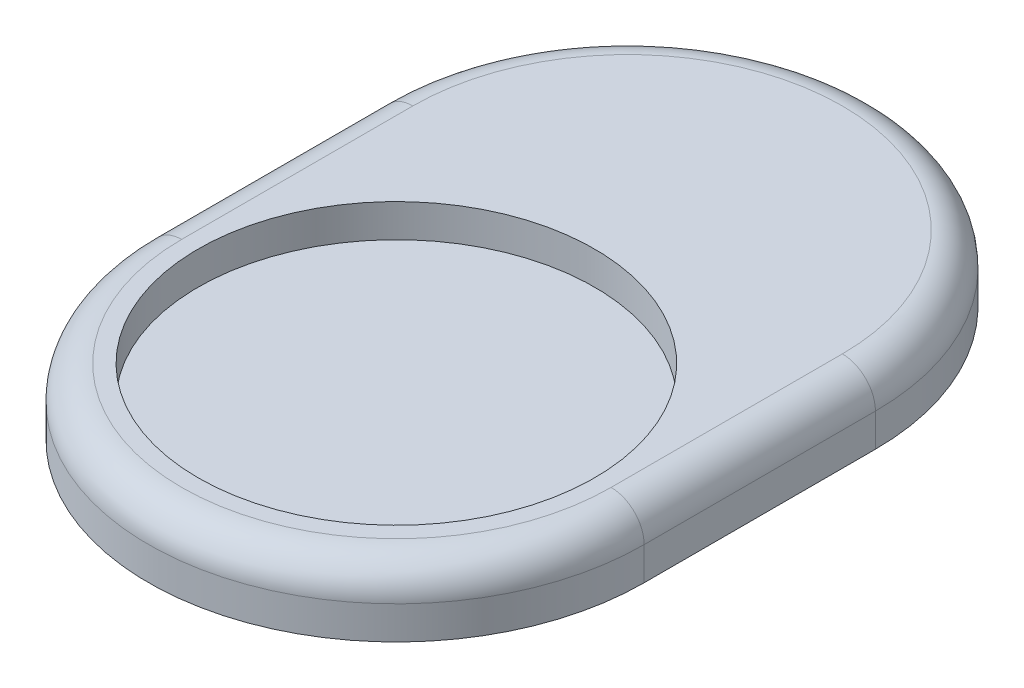
ISO-10303-21;
HEADER;
FILE_DESCRIPTION(('STEP AP214'),'2;1');
FILE_NAME('part.step','',(''),(''),'','','');
FILE_SCHEMA(('AUTOMOTIVE_DESIGN { 1 0 10303 214 1 1 1 1 }'));
ENDSEC;
DATA;
#1=APPLICATION_CONTEXT('core data for automotive mechanical design processes');
#2=APPLICATION_PROTOCOL_DEFINITION('international standard','automotive_design',2000,#1);
#3=PRODUCT_CONTEXT('',#1,'mechanical');
#4=PRODUCT('Part','Part','',(#3));
#5=PRODUCT_RELATED_PRODUCT_CATEGORY('part','',(#4));
#6=PRODUCT_DEFINITION_FORMATION('','',#4);
#7=PRODUCT_DEFINITION_CONTEXT('part definition',#1,'design');
#8=PRODUCT_DEFINITION('design','',#6,#7);
#9=PRODUCT_DEFINITION_SHAPE('','',#8);
#10=(LENGTH_UNIT() NAMED_UNIT(*) SI_UNIT(.MILLI.,.METRE.));
#11=(NAMED_UNIT(*) PLANE_ANGLE_UNIT() SI_UNIT($,.RADIAN.));
#12=(NAMED_UNIT(*) SI_UNIT($,.STERADIAN.) SOLID_ANGLE_UNIT());
#13=UNCERTAINTY_MEASURE_WITH_UNIT(LENGTH_MEASURE(1.E-05),#10,'distance_accuracy_value','');
#14=(GEOMETRIC_REPRESENTATION_CONTEXT(3) GLOBAL_UNCERTAINTY_ASSIGNED_CONTEXT((#13)) GLOBAL_UNIT_ASSIGNED_CONTEXT((#10,
#11,#12)) REPRESENTATION_CONTEXT('',''));
#15=CARTESIAN_POINT('',(0.,0.,0.));
#16=DIRECTION('',(0.,0.,1.));
#17=DIRECTION('',(1.,0.,0.));
#18=AXIS2_PLACEMENT_3D('',#15,#16,#17);
#19=CARTESIAN_POINT('',(0.,2.,0.));
#20=DIRECTION('',(0.,-1.,0.));
#21=DIRECTION('',(0.,0.,-1.));
#22=AXIS2_PLACEMENT_3D('',#19,#20,#21);
#23=CYLINDRICAL_SURFACE('',#22,7.5);
#24=DIRECTION('',(0.,-1.,0.));
#25=VECTOR('',#24,1.);
#26=CARTESIAN_POINT('',(7.5,2.,0.));
#27=LINE('',#26,#25);
#28=CARTESIAN_POINT('',(7.5,1.,0.));
#29=VERTEX_POINT('',#28);
#30=CARTESIAN_POINT('',(7.5,0.,0.));
#31=VERTEX_POINT('',#30);
#32=EDGE_CURVE('E87',#29,#31,#27,.T.);
#33=ORIENTED_EDGE('',*,*,#32,.F.);
#34=CARTESIAN_POINT('',(0.,1.,0.));
#35=DIRECTION('',(0.,1.,0.));
#36=DIRECTION('',(0.,0.,1.));
#37=AXIS2_PLACEMENT_3D('',#34,#35,#36);
#38=CIRCLE('',#37,7.5);
#39=CARTESIAN_POINT('',(-7.5,1.,0.));
#40=VERTEX_POINT('',#39);
#41=EDGE_CURVE('E133',#29,#40,#38,.F.);
#42=ORIENTED_EDGE('',*,*,#41,.T.);
#43=DIRECTION('',(0.,-1.,0.));
#44=VECTOR('',#43,1.);
#45=CARTESIAN_POINT('',(-7.5,2.,0.));
#46=LINE('',#45,#44);
#47=CARTESIAN_POINT('',(-7.5,0.,0.));
#48=VERTEX_POINT('',#47);
#49=EDGE_CURVE('E110',#40,#48,#46,.T.);
#50=ORIENTED_EDGE('',*,*,#49,.T.);
#51=CARTESIAN_POINT('',(0.,0.,0.));
#52=DIRECTION('',(0.,1.,0.));
#53=DIRECTION('',(0.,0.,1.));
#54=AXIS2_PLACEMENT_3D('',#51,#52,#53);
#55=CIRCLE('',#54,7.5);
#56=EDGE_CURVE('E105',#48,#31,#55,.T.);
#57=ORIENTED_EDGE('',*,*,#56,.T.);
#58=EDGE_LOOP('',(#33,#42,#50,#57));
#59=FACE_BOUND('',#58,.T.);
#60=ADVANCED_FACE('F34',(#59),#23,.T.);
#61=CARTESIAN_POINT('',(7.5,2.,0.));
#62=DIRECTION('',(-1.,0.,0.));
#63=DIRECTION('',(0.,0.,1.));
#64=AXIS2_PLACEMENT_3D('',#61,#62,#63);
#65=PLANE('',#64);
#66=DIRECTION('',(0.,-1.,0.));
#67=VECTOR('',#66,1.);
#68=CARTESIAN_POINT('',(7.5,2.,-7.));
#69=LINE('',#68,#67);
#70=CARTESIAN_POINT('',(7.5,1.,-7.));
#71=VERTEX_POINT('',#70);
#72=CARTESIAN_POINT('',(7.5,0.,-7.));
#73=VERTEX_POINT('',#72);
#74=EDGE_CURVE('E99',#71,#73,#69,.T.);
#75=ORIENTED_EDGE('',*,*,#74,.F.);
#76=DIRECTION('',(0.,0.,-1.));
#77=VECTOR('',#76,1.);
#78=CARTESIAN_POINT('',(7.5,1.,0.));
#79=LINE('',#78,#77);
#80=EDGE_CURVE('E93',#71,#29,#79,.F.);
#81=ORIENTED_EDGE('',*,*,#80,.T.);
#82=ORIENTED_EDGE('',*,*,#32,.T.);
#83=DIRECTION('',(0.,0.,-1.));
#84=VECTOR('',#83,1.);
#85=CARTESIAN_POINT('',(7.5,0.,0.));
#86=LINE('',#85,#84);
#87=EDGE_CURVE('E90',#31,#73,#86,.T.);
#88=ORIENTED_EDGE('',*,*,#87,.T.);
#89=EDGE_LOOP('',(#75,#81,#82,#88));
#90=FACE_BOUND('',#89,.T.);
#91=ADVANCED_FACE('F89',(#90),#65,.F.);
#92=CARTESIAN_POINT('',(0.,2.,-7.));
#93=DIRECTION('',(0.,-1.,0.));
#94=DIRECTION('',(0.,0.,-1.));
#95=AXIS2_PLACEMENT_3D('',#92,#93,#94);
#96=CYLINDRICAL_SURFACE('',#95,7.5);
#97=DIRECTION('',(0.,-1.,0.));
#98=VECTOR('',#97,1.);
#99=CARTESIAN_POINT('',(-7.5,2.,-7.));
#100=LINE('',#99,#98);
#101=CARTESIAN_POINT('',(-7.5,1.,-7.));
#102=VERTEX_POINT('',#101);
#103=CARTESIAN_POINT('',(-7.5,0.,-7.));
#104=VERTEX_POINT('',#103);
#105=EDGE_CURVE('E122',#102,#104,#100,.T.);
#106=ORIENTED_EDGE('',*,*,#105,.F.);
#107=CARTESIAN_POINT('',(0.,1.,-7.));
#108=DIRECTION('',(0.,1.,0.));
#109=DIRECTION('',(0.,0.,1.));
#110=AXIS2_PLACEMENT_3D('',#107,#108,#109);
#111=CIRCLE('',#110,7.5);
#112=EDGE_CURVE('E43',#102,#71,#111,.F.);
#113=ORIENTED_EDGE('',*,*,#112,.T.);
#114=ORIENTED_EDGE('',*,*,#74,.T.);
#115=CARTESIAN_POINT('',(0.,0.,-7.));
#116=DIRECTION('',(0.,1.,0.));
#117=DIRECTION('',(0.,0.,1.));
#118=AXIS2_PLACEMENT_3D('',#115,#116,#117);
#119=CIRCLE('',#118,7.5);
#120=EDGE_CURVE('E108',#73,#104,#119,.T.);
#121=ORIENTED_EDGE('',*,*,#120,.T.);
#122=EDGE_LOOP('',(#106,#113,#114,#121));
#123=FACE_BOUND('',#122,.T.);
#124=ADVANCED_FACE('F164',(#123),#96,.T.);
#125=CARTESIAN_POINT('',(-7.5,2.,0.));
#126=DIRECTION('',(-1.,0.,0.));
#127=DIRECTION('',(0.,0.,1.));
#128=AXIS2_PLACEMENT_3D('',#125,#126,#127);
#129=PLANE('',#128);
#130=ORIENTED_EDGE('',*,*,#49,.F.);
#131=DIRECTION('',(0.,0.,-1.));
#132=VECTOR('',#131,1.);
#133=CARTESIAN_POINT('',(-7.5,1.,0.));
#134=LINE('',#133,#132);
#135=EDGE_CURVE('E11',#40,#102,#134,.T.);
#136=ORIENTED_EDGE('',*,*,#135,.T.);
#137=ORIENTED_EDGE('',*,*,#105,.T.);
#138=DIRECTION('',(0.,0.,-1.));
#139=VECTOR('',#138,1.);
#140=CARTESIAN_POINT('',(-7.5,0.,0.));
#141=LINE('',#140,#139);
#142=EDGE_CURVE('E119',#48,#104,#141,.T.);
#143=ORIENTED_EDGE('',*,*,#142,.F.);
#144=EDGE_LOOP('',(#130,#136,#137,#143));
#145=FACE_BOUND('',#144,.T.);
#146=ADVANCED_FACE('F156',(#145),#129,.T.);
#147=CARTESIAN_POINT('',(0.,2.,0.));
#148=DIRECTION('',(0.,1.,0.));
#149=DIRECTION('',(0.,0.,1.));
#150=AXIS2_PLACEMENT_3D('',#147,#148,#149);
#151=PLANE('',#150);
#152=DIRECTION('',(0.,0.,-1.));
#153=VECTOR('',#152,1.);
#154=CARTESIAN_POINT('',(-6.5,2.,0.));
#155=LINE('',#154,#153);
#156=CARTESIAN_POINT('',(-6.5,2.,-7.));
#157=VERTEX_POINT('',#156);
#158=CARTESIAN_POINT('',(-6.5,2.,0.));
#159=VERTEX_POINT('',#158);
#160=EDGE_CURVE('E98',#157,#159,#155,.F.);
#161=ORIENTED_EDGE('',*,*,#160,.T.);
#162=CARTESIAN_POINT('',(0.,2.,0.));
#163=DIRECTION('',(0.,1.,0.));
#164=DIRECTION('',(0.,0.,1.));
#165=AXIS2_PLACEMENT_3D('',#162,#163,#164);
#166=CIRCLE('',#165,6.5);
#167=CARTESIAN_POINT('',(6.5,2.,0.));
#168=VERTEX_POINT('',#167);
#169=EDGE_CURVE('E130',#159,#168,#166,.T.);
#170=ORIENTED_EDGE('',*,*,#169,.T.);
#171=DIRECTION('',(0.,0.,-1.));
#172=VECTOR('',#171,1.);
#173=CARTESIAN_POINT('',(6.5,2.,-7.));
#174=LINE('',#173,#172);
#175=CARTESIAN_POINT('',(6.5,2.,-7.));
#176=VERTEX_POINT('',#175);
#177=EDGE_CURVE('E128',#168,#176,#174,.T.);
#178=ORIENTED_EDGE('',*,*,#177,.T.);
#179=CARTESIAN_POINT('',(0.,2.,-7.));
#180=DIRECTION('',(0.,1.,0.));
#181=DIRECTION('',(0.,0.,1.));
#182=AXIS2_PLACEMENT_3D('',#179,#180,#181);
#183=CIRCLE('',#182,6.5);
#184=EDGE_CURVE('E126',#176,#157,#183,.T.);
#185=ORIENTED_EDGE('',*,*,#184,.T.);
#186=EDGE_LOOP('',(#161,#170,#178,#185));
#187=FACE_BOUND('',#186,.T.);
#188=CARTESIAN_POINT('',(0.,2.,0.));
#189=DIRECTION('',(0.,1.,0.));
#190=DIRECTION('',(0.,0.,1.));
#191=AXIS2_PLACEMENT_3D('',#188,#189,#190);
#192=CIRCLE('',#191,6.);
#193=CARTESIAN_POINT('',(0.,2.,6.));
#194=VERTEX_POINT('',#193);
#195=EDGE_CURVE('E114',#194,#194,#192,.T.);
#196=ORIENTED_EDGE('',*,*,#195,.F.);
#197=EDGE_LOOP('',(#196));
#198=FACE_BOUND('',#197,.T.);
#199=ADVANCED_FACE('F154',(#187,#198),#151,.T.);
#200=CARTESIAN_POINT('',(0.,0.,0.));
#201=DIRECTION('',(0.,1.,0.));
#202=DIRECTION('',(0.,0.,1.));
#203=AXIS2_PLACEMENT_3D('',#200,#201,#202);
#204=PLANE('',#203);
#205=ORIENTED_EDGE('',*,*,#56,.F.);
#206=ORIENTED_EDGE('',*,*,#142,.T.);
#207=ORIENTED_EDGE('',*,*,#120,.F.);
#208=ORIENTED_EDGE('',*,*,#87,.F.);
#209=EDGE_LOOP('',(#205,#206,#207,#208));
#210=FACE_BOUND('',#209,.T.);
#211=ADVANCED_FACE('F103',(#210),#204,.F.);
#212=CARTESIAN_POINT('',(0.,1.,0.));
#213=DIRECTION('',(0.,1.,0.));
#214=DIRECTION('',(0.,0.,1.));
#215=AXIS2_PLACEMENT_3D('',#212,#213,#214);
#216=CYLINDRICAL_SURFACE('',#215,6.);
#217=CARTESIAN_POINT('',(0.,1.,0.));
#218=DIRECTION('',(0.,1.,0.));
#219=DIRECTION('',(0.,0.,1.));
#220=AXIS2_PLACEMENT_3D('',#217,#218,#219);
#221=CIRCLE('',#220,6.);
#222=CARTESIAN_POINT('',(0.,1.,6.));
#223=VERTEX_POINT('',#222);
#224=EDGE_CURVE('E111',#223,#223,#221,.T.);
#225=ORIENTED_EDGE('',*,*,#224,.F.);
#226=EDGE_LOOP('',(#225));
#227=FACE_BOUND('',#226,.T.);
#228=ORIENTED_EDGE('',*,*,#195,.T.);
#229=EDGE_LOOP('',(#228));
#230=FACE_BOUND('',#229,.T.);
#231=ADVANCED_FACE('F152',(#227,#230),#216,.F.);
#232=CARTESIAN_POINT('',(0.,1.,0.));
#233=DIRECTION('',(0.,1.,0.));
#234=DIRECTION('',(0.,0.,1.));
#235=AXIS2_PLACEMENT_3D('',#232,#233,#234);
#236=PLANE('',#235);
#237=ORIENTED_EDGE('',*,*,#224,.T.);
#238=EDGE_LOOP('',(#237));
#239=FACE_BOUND('',#238,.T.);
#240=ADVANCED_FACE('F186',(#239),#236,.T.);
#241=CARTESIAN_POINT('',(0.,1.,-7.));
#242=DIRECTION('',(0.,1.,0.));
#243=DIRECTION('',(0.,0.,1.));
#244=AXIS2_PLACEMENT_3D('',#241,#242,#243);
#245=TOROIDAL_SURFACE('',#244,6.5,1.);
#246=CARTESIAN_POINT('',(6.5,1.,-7.));
#247=DIRECTION('',(0.,0.,1.));
#248=DIRECTION('',(1.,0.,0.));
#249=AXIS2_PLACEMENT_3D('',#246,#247,#248);
#250=CIRCLE('',#249,1.);
#251=EDGE_CURVE('E140',#71,#176,#250,.T.);
#252=ORIENTED_EDGE('',*,*,#251,.F.);
#253=ORIENTED_EDGE('',*,*,#112,.F.);
#254=CARTESIAN_POINT('',(-6.5,1.,-7.));
#255=DIRECTION('',(0.,0.,1.));
#256=DIRECTION('',(1.,0.,0.));
#257=AXIS2_PLACEMENT_3D('',#254,#255,#256);
#258=CIRCLE('',#257,1.);
#259=EDGE_CURVE('E38',#157,#102,#258,.T.);
#260=ORIENTED_EDGE('',*,*,#259,.F.);
#261=ORIENTED_EDGE('',*,*,#184,.F.);
#262=EDGE_LOOP('',(#252,#253,#260,#261));
#263=FACE_BOUND('',#262,.T.);
#264=ADVANCED_FACE('F36',(#263),#245,.T.);
#265=CARTESIAN_POINT('',(-6.5,1.,0.));
#266=DIRECTION('',(0.,0.,-1.));
#267=DIRECTION('',(-1.,0.,0.));
#268=AXIS2_PLACEMENT_3D('',#265,#266,#267);
#269=CYLINDRICAL_SURFACE('',#268,1.);
#270=ORIENTED_EDGE('',*,*,#259,.T.);
#271=ORIENTED_EDGE('',*,*,#135,.F.);
#272=CARTESIAN_POINT('',(-6.5,1.,0.));
#273=DIRECTION('',(0.,0.,1.));
#274=DIRECTION('',(1.,0.,0.));
#275=AXIS2_PLACEMENT_3D('',#272,#273,#274);
#276=CIRCLE('',#275,1.);
#277=EDGE_CURVE('E139',#159,#40,#276,.T.);
#278=ORIENTED_EDGE('',*,*,#277,.F.);
#279=ORIENTED_EDGE('',*,*,#160,.F.);
#280=EDGE_LOOP('',(#270,#271,#278,#279));
#281=FACE_BOUND('',#280,.T.);
#282=ADVANCED_FACE('F181',(#281),#269,.T.);
#283=CARTESIAN_POINT('',(6.5,1.,0.));
#284=DIRECTION('',(0.,0.,1.));
#285=DIRECTION('',(1.,0.,0.));
#286=AXIS2_PLACEMENT_3D('',#283,#284,#285);
#287=CYLINDRICAL_SURFACE('',#286,1.);
#288=ORIENTED_EDGE('',*,*,#251,.T.);
#289=ORIENTED_EDGE('',*,*,#177,.F.);
#290=CARTESIAN_POINT('',(6.5,1.,0.));
#291=DIRECTION('',(0.,0.,1.));
#292=DIRECTION('',(1.,0.,0.));
#293=AXIS2_PLACEMENT_3D('',#290,#291,#292);
#294=CIRCLE('',#293,1.);
#295=EDGE_CURVE('E137',#29,#168,#294,.T.);
#296=ORIENTED_EDGE('',*,*,#295,.F.);
#297=ORIENTED_EDGE('',*,*,#80,.F.);
#298=EDGE_LOOP('',(#288,#289,#296,#297));
#299=FACE_BOUND('',#298,.T.);
#300=ADVANCED_FACE('F178',(#299),#287,.T.);
#301=CARTESIAN_POINT('',(0.,1.,0.));
#302=DIRECTION('',(0.,1.,0.));
#303=DIRECTION('',(0.,0.,1.));
#304=AXIS2_PLACEMENT_3D('',#301,#302,#303);
#305=TOROIDAL_SURFACE('',#304,6.5,1.);
#306=ORIENTED_EDGE('',*,*,#277,.T.);
#307=ORIENTED_EDGE('',*,*,#41,.F.);
#308=ORIENTED_EDGE('',*,*,#295,.T.);
#309=ORIENTED_EDGE('',*,*,#169,.F.);
#310=EDGE_LOOP('',(#306,#307,#308,#309));
#311=FACE_BOUND('',#310,.T.);
#312=ADVANCED_FACE('F175',(#311),#305,.T.);
#313=CLOSED_SHELL('',(#60,#91,#124,#146,#199,#211,#231,#240,#264,#282,#300,#312));
#314=MANIFOLD_SOLID_BREP('B2',#313);
#315=ADVANCED_BREP_SHAPE_REPRESENTATION('',(#18,#314),#14);
#316=SHAPE_DEFINITION_REPRESENTATION(#9,#315);
ENDSEC;
END-ISO-10303-21;
